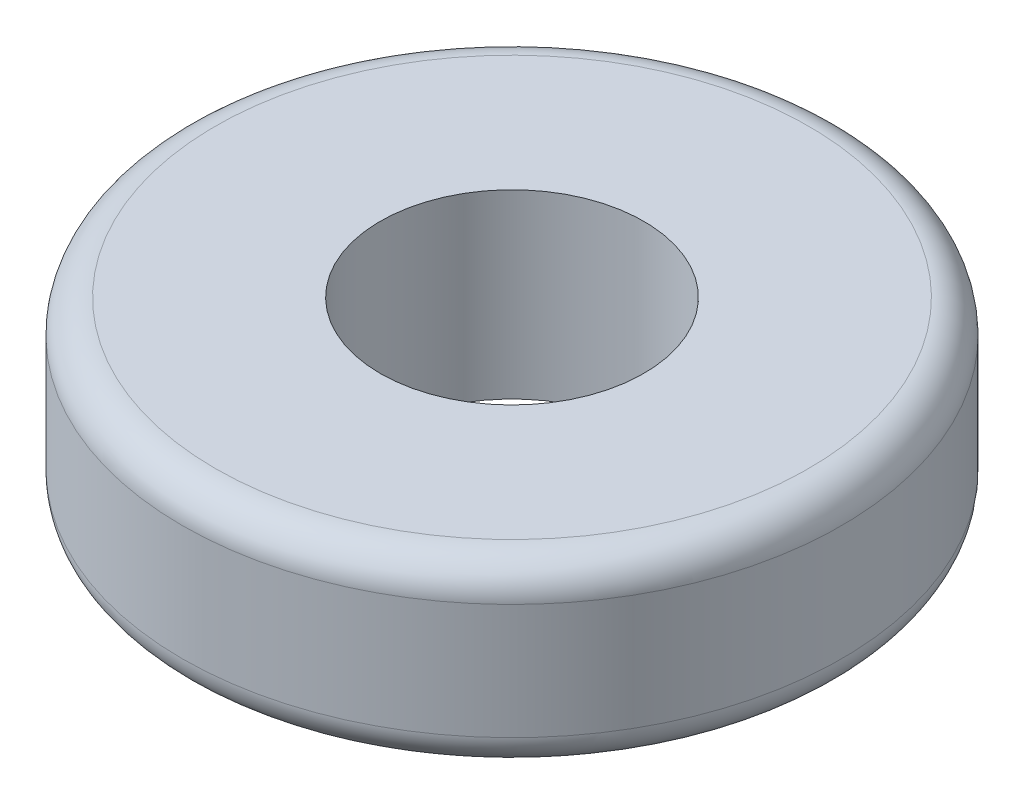
ISO-10303-21;
HEADER;
FILE_DESCRIPTION(('STEP AP214'),'2;1');
FILE_NAME('part.step','',(''),(''),'','','');
FILE_SCHEMA(('AUTOMOTIVE_DESIGN { 1 0 10303 214 1 1 1 1 }'));
ENDSEC;
DATA;
#1=APPLICATION_CONTEXT('core data for automotive mechanical design processes');
#2=APPLICATION_PROTOCOL_DEFINITION('international standard','automotive_design',2000,#1);
#3=PRODUCT_CONTEXT('',#1,'mechanical');
#4=PRODUCT('Part','Part','',(#3));
#5=PRODUCT_RELATED_PRODUCT_CATEGORY('part','',(#4));
#6=PRODUCT_DEFINITION_FORMATION('','',#4);
#7=PRODUCT_DEFINITION_CONTEXT('part definition',#1,'design');
#8=PRODUCT_DEFINITION('design','',#6,#7);
#9=PRODUCT_DEFINITION_SHAPE('','',#8);
#10=(LENGTH_UNIT() NAMED_UNIT(*) SI_UNIT(.MILLI.,.METRE.));
#11=(NAMED_UNIT(*) PLANE_ANGLE_UNIT() SI_UNIT($,.RADIAN.));
#12=(NAMED_UNIT(*) SI_UNIT($,.STERADIAN.) SOLID_ANGLE_UNIT());
#13=UNCERTAINTY_MEASURE_WITH_UNIT(LENGTH_MEASURE(1.E-05),#10,'distance_accuracy_value','');
#14=(GEOMETRIC_REPRESENTATION_CONTEXT(3) GLOBAL_UNCERTAINTY_ASSIGNED_CONTEXT((#13)) GLOBAL_UNIT_ASSIGNED_CONTEXT((#10,
#11,#12)) REPRESENTATION_CONTEXT('',''));
#15=CARTESIAN_POINT('',(0.,0.,0.));
#16=DIRECTION('',(0.,0.,1.));
#17=DIRECTION('',(1.,0.,0.));
#18=AXIS2_PLACEMENT_3D('',#15,#16,#17);
#19=CARTESIAN_POINT('',(0.,5.5,0.));
#20=DIRECTION('',(0.,1.,0.));
#21=DIRECTION('',(0.,0.,1.));
#22=AXIS2_PLACEMENT_3D('',#19,#20,#21);
#23=PLANE('',#22);
#24=CARTESIAN_POINT('',(0.,5.5,0.));
#25=DIRECTION('',(0.,1.,0.));
#26=DIRECTION('',(0.,0.,1.));
#27=AXIS2_PLACEMENT_3D('',#24,#25,#26);
#28=CIRCLE('',#27,9.);
#29=CARTESIAN_POINT('',(0.,5.5,9.));
#30=VERTEX_POINT('',#29);
#31=EDGE_CURVE('E10',#30,#30,#28,.T.);
#32=ORIENTED_EDGE('',*,*,#31,.T.);
#33=EDGE_LOOP('',(#32));
#34=FACE_BOUND('',#33,.T.);
#35=CARTESIAN_POINT('',(0.,5.5,0.));
#36=DIRECTION('',(0.,1.,0.));
#37=DIRECTION('',(0.,0.,1.));
#38=AXIS2_PLACEMENT_3D('',#35,#36,#37);
#39=CIRCLE('',#38,4.);
#40=CARTESIAN_POINT('',(0.,5.5,4.));
#41=VERTEX_POINT('',#40);
#42=EDGE_CURVE('E51',#41,#41,#39,.T.);
#43=ORIENTED_EDGE('',*,*,#42,.F.);
#44=EDGE_LOOP('',(#43));
#45=FACE_BOUND('',#44,.T.);
#46=ADVANCED_FACE('F31',(#34,#45),#23,.T.);
#47=CARTESIAN_POINT('',(0.,0.,0.));
#48=DIRECTION('',(0.,1.,0.));
#49=DIRECTION('',(0.,0.,1.));
#50=AXIS2_PLACEMENT_3D('',#47,#48,#49);
#51=PLANE('',#50);
#52=CARTESIAN_POINT('',(0.,0.,0.));
#53=DIRECTION('',(0.,1.,0.));
#54=DIRECTION('',(0.,0.,1.));
#55=AXIS2_PLACEMENT_3D('',#52,#53,#54);
#56=CIRCLE('',#55,9.);
#57=CARTESIAN_POINT('',(0.,0.,9.));
#58=VERTEX_POINT('',#57);
#59=EDGE_CURVE('E38',#58,#58,#56,.F.);
#60=ORIENTED_EDGE('',*,*,#59,.T.);
#61=EDGE_LOOP('',(#60));
#62=FACE_BOUND('',#61,.T.);
#63=CARTESIAN_POINT('',(0.,0.,0.));
#64=DIRECTION('',(0.,1.,0.));
#65=DIRECTION('',(0.,0.,1.));
#66=AXIS2_PLACEMENT_3D('',#63,#64,#65);
#67=CIRCLE('',#66,4.);
#68=CARTESIAN_POINT('',(0.,0.,4.));
#69=VERTEX_POINT('',#68);
#70=EDGE_CURVE('E52',#69,#69,#67,.T.);
#71=ORIENTED_EDGE('',*,*,#70,.T.);
#72=EDGE_LOOP('',(#71));
#73=FACE_BOUND('',#72,.T.);
#74=ADVANCED_FACE('F62',(#62,#73),#51,.F.);
#75=CARTESIAN_POINT('',(0.,5.5,0.));
#76=DIRECTION('',(0.,-1.,0.));
#77=DIRECTION('',(0.,0.,-1.));
#78=AXIS2_PLACEMENT_3D('',#75,#76,#77);
#79=CYLINDRICAL_SURFACE('',#78,10.);
#80=CARTESIAN_POINT('',(0.,1.,0.));
#81=DIRECTION('',(0.,1.,0.));
#82=DIRECTION('',(0.,0.,1.));
#83=AXIS2_PLACEMENT_3D('',#80,#81,#82);
#84=CIRCLE('',#83,10.);
#85=CARTESIAN_POINT('',(0.,1.,10.));
#86=VERTEX_POINT('',#85);
#87=EDGE_CURVE('E42',#86,#86,#84,.T.);
#88=ORIENTED_EDGE('',*,*,#87,.T.);
#89=EDGE_LOOP('',(#88));
#90=FACE_BOUND('',#89,.T.);
#91=CARTESIAN_POINT('',(0.,4.5,0.));
#92=DIRECTION('',(0.,1.,0.));
#93=DIRECTION('',(0.,0.,1.));
#94=AXIS2_PLACEMENT_3D('',#91,#92,#93);
#95=CIRCLE('',#94,10.);
#96=CARTESIAN_POINT('',(0.,4.5,10.));
#97=VERTEX_POINT('',#96);
#98=EDGE_CURVE('E46',#97,#97,#95,.F.);
#99=ORIENTED_EDGE('',*,*,#98,.T.);
#100=EDGE_LOOP('',(#99));
#101=FACE_BOUND('',#100,.T.);
#102=ADVANCED_FACE('F67',(#90,#101),#79,.T.);
#103=CARTESIAN_POINT('',(0.,5.5,0.));
#104=DIRECTION('',(0.,-1.,0.));
#105=DIRECTION('',(0.,0.,-1.));
#106=AXIS2_PLACEMENT_3D('',#103,#104,#105);
#107=CYLINDRICAL_SURFACE('',#106,4.);
#108=ORIENTED_EDGE('',*,*,#42,.T.);
#109=EDGE_LOOP('',(#108));
#110=FACE_BOUND('',#109,.T.);
#111=ORIENTED_EDGE('',*,*,#70,.F.);
#112=EDGE_LOOP('',(#111));
#113=FACE_BOUND('',#112,.T.);
#114=ADVANCED_FACE('F58',(#110,#113),#107,.F.);
#115=CARTESIAN_POINT('',(0.,1.,0.));
#116=DIRECTION('',(0.,1.,0.));
#117=DIRECTION('',(0.,0.,1.));
#118=AXIS2_PLACEMENT_3D('',#115,#116,#117);
#119=TOROIDAL_SURFACE('',#118,9.,1.);
#120=ORIENTED_EDGE('',*,*,#59,.F.);
#121=EDGE_LOOP('',(#120));
#122=FACE_BOUND('',#121,.T.);
#123=ORIENTED_EDGE('',*,*,#87,.F.);
#124=EDGE_LOOP('',(#123));
#125=FACE_BOUND('',#124,.T.);
#126=ADVANCED_FACE('F73',(#122,#125),#119,.T.);
#127=CARTESIAN_POINT('',(0.,4.5,0.));
#128=DIRECTION('',(0.,1.,0.));
#129=DIRECTION('',(0.,0.,1.));
#130=AXIS2_PLACEMENT_3D('',#127,#128,#129);
#131=TOROIDAL_SURFACE('',#130,9.,1.);
#132=ORIENTED_EDGE('',*,*,#98,.F.);
#133=EDGE_LOOP('',(#132));
#134=FACE_BOUND('',#133,.T.);
#135=ORIENTED_EDGE('',*,*,#31,.F.);
#136=EDGE_LOOP('',(#135));
#137=FACE_BOUND('',#136,.T.);
#138=ADVANCED_FACE('F33',(#134,#137),#131,.T.);
#139=CLOSED_SHELL('',(#46,#74,#102,#114,#126,#138));
#140=MANIFOLD_SOLID_BREP('B2',#139);
#141=ADVANCED_BREP_SHAPE_REPRESENTATION('',(#18,#140),#14);
#142=SHAPE_DEFINITION_REPRESENTATION(#9,#141);
ENDSEC;
END-ISO-10303-21;
